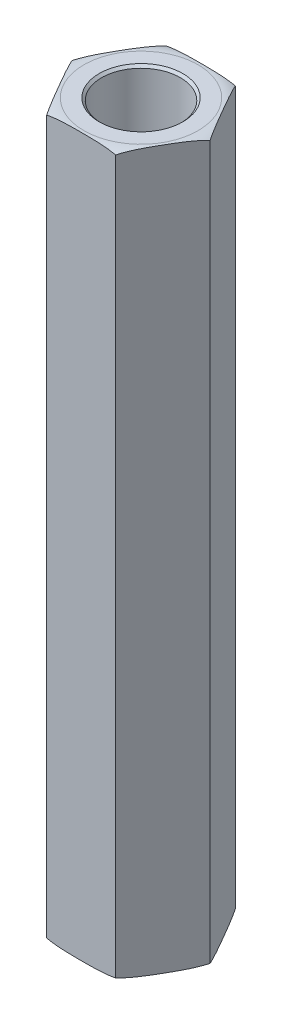
ISO-10303-21;
HEADER;
FILE_DESCRIPTION(('STEP AP214'),'2;1');
FILE_NAME('part.step','',(''),(''),'','','');
FILE_SCHEMA(('AUTOMOTIVE_DESIGN { 1 0 10303 214 1 1 1 1 }'));
ENDSEC;
DATA;
#1=APPLICATION_CONTEXT('core data for automotive mechanical design processes');
#2=APPLICATION_PROTOCOL_DEFINITION('international standard','automotive_design',2000,#1);
#3=PRODUCT_CONTEXT('',#1,'mechanical');
#4=PRODUCT('Part','Part','',(#3));
#5=PRODUCT_RELATED_PRODUCT_CATEGORY('part','',(#4));
#6=PRODUCT_DEFINITION_FORMATION('','',#4);
#7=PRODUCT_DEFINITION_CONTEXT('part definition',#1,'design');
#8=PRODUCT_DEFINITION('design','',#6,#7);
#9=PRODUCT_DEFINITION_SHAPE('','',#8);
#10=(LENGTH_UNIT() NAMED_UNIT(*) SI_UNIT(.MILLI.,.METRE.));
#11=(NAMED_UNIT(*) PLANE_ANGLE_UNIT() SI_UNIT($,.RADIAN.));
#12=(NAMED_UNIT(*) SI_UNIT($,.STERADIAN.) SOLID_ANGLE_UNIT());
#13=UNCERTAINTY_MEASURE_WITH_UNIT(LENGTH_MEASURE(1.E-05),#10,'distance_accuracy_value','');
#14=(GEOMETRIC_REPRESENTATION_CONTEXT(3) GLOBAL_UNCERTAINTY_ASSIGNED_CONTEXT((#13)) GLOBAL_UNIT_ASSIGNED_CONTEXT((#10,
#11,#12)) REPRESENTATION_CONTEXT('',''));
#15=CARTESIAN_POINT('',(0.,0.,0.));
#16=DIRECTION('',(0.,0.,1.));
#17=DIRECTION('',(1.,0.,0.));
#18=AXIS2_PLACEMENT_3D('',#15,#16,#17);
#19=CARTESIAN_POINT('',(0.,-6.35,0.));
#20=DIRECTION('',(0.,-1.,0.));
#21=DIRECTION('',(0.,0.,-1.));
#22=AXIS2_PLACEMENT_3D('',#19,#20,#21);
#23=PLANE('',#22);
#24=CARTESIAN_POINT('',(0.,-6.35,0.));
#25=DIRECTION('',(0.,-1.,0.));
#26=DIRECTION('',(0.,0.,-1.));
#27=AXIS2_PLACEMENT_3D('',#24,#25,#26);
#28=CIRCLE('',#27,2.0955);
#29=CARTESIAN_POINT('',(0.,-6.35,-2.0955));
#30=VERTEX_POINT('',#29);
#31=EDGE_CURVE('E22',#30,#30,#28,.T.);
#32=ORIENTED_EDGE('',*,*,#31,.T.);
#33=EDGE_LOOP('',(#32));
#34=FACE_BOUND('',#33,.T.);
#35=ADVANCED_FACE('F17',(#34),#23,.T.);
#36=CARTESIAN_POINT('',(0.,-6.35,0.));
#37=DIRECTION('',(0.,-1.,0.));
#38=DIRECTION('',(0.,0.,-1.));
#39=AXIS2_PLACEMENT_3D('',#36,#37,#38);
#40=CYLINDRICAL_SURFACE('',#39,2.0955);
#41=ORIENTED_EDGE('',*,*,#31,.F.);
#42=EDGE_LOOP('',(#41));
#43=FACE_BOUND('',#42,.T.);
#44=CARTESIAN_POINT('',(0.,-18.9229999999725,0.));
#45=DIRECTION('',(0.,-1.,0.));
#46=DIRECTION('',(0.,0.,-1.));
#47=AXIS2_PLACEMENT_3D('',#44,#45,#46);
#48=CIRCLE('',#47,2.09550000005265);
#49=CARTESIAN_POINT('',(0.,-18.9229999999725,-2.09550000005265));
#50=VERTEX_POINT('',#49);
#51=EDGE_CURVE('E127',#50,#50,#48,.T.);
#52=ORIENTED_EDGE('',*,*,#51,.T.);
#53=EDGE_LOOP('',(#52));
#54=FACE_BOUND('',#53,.T.);
#55=ADVANCED_FACE('F238',(#43,#54),#40,.F.);
#56=CARTESIAN_POINT('',(0.,6.35,0.));
#57=DIRECTION('',(0.,1.,0.));
#58=DIRECTION('',(0.,0.,1.));
#59=AXIS2_PLACEMENT_3D('',#56,#57,#58);
#60=PLANE('',#59);
#61=CARTESIAN_POINT('',(0.,6.35,0.));
#62=DIRECTION('',(0.,1.,0.));
#63=DIRECTION('',(0.,0.,1.));
#64=AXIS2_PLACEMENT_3D('',#61,#62,#63);
#65=CIRCLE('',#64,2.0955);
#66=CARTESIAN_POINT('',(0.,6.35,2.0955));
#67=VERTEX_POINT('',#66);
#68=EDGE_CURVE('E105',#67,#67,#65,.T.);
#69=ORIENTED_EDGE('',*,*,#68,.T.);
#70=EDGE_LOOP('',(#69));
#71=FACE_BOUND('',#70,.T.);
#72=ADVANCED_FACE('F242',(#71),#60,.T.);
#73=CARTESIAN_POINT('',(0.,-19.0499999999361,0.));
#74=DIRECTION('',(0.,-1.,0.));
#75=DIRECTION('',(0.,0.,-1.));
#76=AXIS2_PLACEMENT_3D('',#73,#74,#75);
#77=CONICAL_SURFACE('',#76,2.22250000001623,0.785398163397448);
#78=ORIENTED_EDGE('',*,*,#51,.F.);
#79=EDGE_LOOP('',(#78));
#80=FACE_BOUND('',#79,.T.);
#81=CARTESIAN_POINT('',(0.,-19.0499999999361,0.));
#82=DIRECTION('',(0.,-1.,0.));
#83=DIRECTION('',(0.,0.,-1.));
#84=AXIS2_PLACEMENT_3D('',#81,#82,#83);
#85=CIRCLE('',#84,2.22250000001623);
#86=CARTESIAN_POINT('',(0.,-19.0499999999361,-2.22250000001623));
#87=VERTEX_POINT('',#86);
#88=EDGE_CURVE('E116',#87,#87,#85,.F.);
#89=ORIENTED_EDGE('',*,*,#88,.F.);
#90=EDGE_LOOP('',(#89));
#91=FACE_BOUND('',#90,.T.);
#92=ADVANCED_FACE('F246',(#80,#91),#77,.F.);
#93=CARTESIAN_POINT('',(0.,6.35,0.));
#94=DIRECTION('',(0.,1.,0.));
#95=DIRECTION('',(0.,0.,1.));
#96=AXIS2_PLACEMENT_3D('',#93,#94,#95);
#97=CYLINDRICAL_SURFACE('',#96,2.0955);
#98=ORIENTED_EDGE('',*,*,#68,.F.);
#99=EDGE_LOOP('',(#98));
#100=FACE_BOUND('',#99,.T.);
#101=CARTESIAN_POINT('',(0.,18.9229999999725,0.));
#102=DIRECTION('',(0.,1.,0.));
#103=DIRECTION('',(0.,0.,1.));
#104=AXIS2_PLACEMENT_3D('',#101,#102,#103);
#105=CIRCLE('',#104,2.09550000005265);
#106=CARTESIAN_POINT('',(0.,18.9229999999725,2.09550000005265));
#107=VERTEX_POINT('',#106);
#108=EDGE_CURVE('E110',#107,#107,#105,.T.);
#109=ORIENTED_EDGE('',*,*,#108,.T.);
#110=EDGE_LOOP('',(#109));
#111=FACE_BOUND('',#110,.T.);
#112=ADVANCED_FACE('F249',(#100,#111),#97,.F.);
#113=CARTESIAN_POINT('',(-1.83308710468,-19.05,-3.175));
#114=DIRECTION('',(0.,-1.,0.));
#115=DIRECTION('',(0.,0.,-1.));
#116=AXIS2_PLACEMENT_3D('',#113,#114,#115);
#117=PLANE('',#116);
#118=ORIENTED_EDGE('',*,*,#88,.T.);
#119=EDGE_LOOP('',(#118));
#120=FACE_BOUND('',#119,.T.);
#121=CARTESIAN_POINT('',(1.1159149628,-19.05,2.81828864442));
#122=CARTESIAN_POINT('',(0.578263806384786,-19.05,3.03117420935));
#123=CARTESIAN_POINT('',(0.,-19.05,3.03117420935));
#124=B_SPLINE_CURVE_WITH_KNOTS('',2,(#121,#122,#123),.UNSPECIFIED.,.F.,.F.,(3,3),(0.,1.),.UNSPECIFIED.);
#125=CARTESIAN_POINT('',(1.1159149628,-19.05,2.81828864442));
#126=VERTEX_POINT('',#125);
#127=CARTESIAN_POINT('',(0.,-19.0499999999903,3.03117420935001));
#128=VERTEX_POINT('',#127);
#129=EDGE_CURVE('E108',#126,#128,#124,.T.);
#130=ORIENTED_EDGE('',*,*,#129,.T.);
#131=CARTESIAN_POINT('',(0.,-19.0499999999806,0.));
#132=DIRECTION('',(0.,-1.,0.));
#133=DIRECTION('',(0.,0.,-1.));
#134=AXIS2_PLACEMENT_3D('',#131,#132,#133);
#135=CIRCLE('',#134,3.03117420935);
#136=CARTESIAN_POINT('',(0.,-19.0499999999903,-3.03117420935001));
#137=VERTEX_POINT('',#136);
#138=EDGE_CURVE('E101',#137,#128,#135,.F.);
#139=ORIENTED_EDGE('',*,*,#138,.F.);
#140=CARTESIAN_POINT('',(0.,-19.05,-3.03117420935));
#141=CARTESIAN_POINT('',(0.578261264918406,-19.05,-3.03117420935));
#142=CARTESIAN_POINT('',(1.11591040282,-19.05,-2.81829044996));
#143=B_SPLINE_CURVE_WITH_KNOTS('',2,(#140,#141,#142),.UNSPECIFIED.,.F.,.F.,(3,3),(0.,1.),.UNSPECIFIED.);
#144=CARTESIAN_POINT('',(1.11591040282,-19.05,-2.81829044996));
#145=VERTEX_POINT('',#144);
#146=EDGE_CURVE('E97',#137,#145,#143,.T.);
#147=ORIENTED_EDGE('',*,*,#146,.T.);
#148=CARTESIAN_POINT('',(1.11591040282,-19.05,-2.81829044996));
#149=CARTESIAN_POINT('',(1.69952038244857,-19.05,-2.58720835993238));
#150=CARTESIAN_POINT('',(2.14336641133,-19.05,-2.14336126545));
#151=B_SPLINE_CURVE_WITH_KNOTS('',2,(#148,#149,#150),.UNSPECIFIED.,.F.,.F.,(3,3),(0.,1.),.UNSPECIFIED.);
#152=CARTESIAN_POINT('',(2.14336641133,-19.05,-2.14336126545));
#153=VERTEX_POINT('',#152);
#154=EDGE_CURVE('E103',#145,#153,#151,.T.);
#155=ORIENTED_EDGE('',*,*,#154,.T.);
#156=CARTESIAN_POINT('',(2.14336641133,-19.05,-2.14336126545));
#157=CARTESIAN_POINT('',(2.58720785568844,-19.05,-1.69951875549663));
#158=CARTESIAN_POINT('',(2.81828855163,-19.05,-1.11591519714));
#159=B_SPLINE_CURVE_WITH_KNOTS('',2,(#156,#157,#158),.UNSPECIFIED.,.F.,.F.,(3,3),(0.,1.),.UNSPECIFIED.);
#160=CARTESIAN_POINT('',(2.81828855163,-19.05,-1.11591519714));
#161=VERTEX_POINT('',#160);
#162=EDGE_CURVE('E268',#153,#161,#159,.T.);
#163=ORIENTED_EDGE('',*,*,#162,.T.);
#164=CARTESIAN_POINT('',(2.81828855163,-19.05,-1.11591519714));
#165=CARTESIAN_POINT('',(3.03117326999005,-19.05,-0.578266309377845));
#166=CARTESIAN_POINT('',(3.03117420935,-19.05,-4.92400771632401E-06));
#167=B_SPLINE_CURVE_WITH_KNOTS('',2,(#164,#165,#166),.UNSPECIFIED.,.F.,.F.,(3,3),(0.,1.),.UNSPECIFIED.);
#168=CARTESIAN_POINT('',(3.03117420935,-19.05,-4.92400771632401E-06));
#169=VERTEX_POINT('',#168);
#170=EDGE_CURVE('E272',#161,#169,#167,.T.);
#171=ORIENTED_EDGE('',*,*,#170,.T.);
#172=CARTESIAN_POINT('',(3.03117420935,-19.05,-4.92400771632401E-06));
#173=CARTESIAN_POINT('',(3.03117514871005,-19.05,0.578257948095633));
#174=CARTESIAN_POINT('',(2.81829112091,-19.05,1.11590870829));
#175=B_SPLINE_CURVE_WITH_KNOTS('',2,(#172,#173,#174),.UNSPECIFIED.,.F.,.F.,(3,3),(0.,1.),.UNSPECIFIED.);
#176=CARTESIAN_POINT('',(2.81829112091,-19.05,1.11590870829));
#177=VERTEX_POINT('',#176);
#178=EDGE_CURVE('E276',#169,#177,#175,.T.);
#179=ORIENTED_EDGE('',*,*,#178,.T.);
#180=CARTESIAN_POINT('',(2.81829112091,-19.05,1.11590870829));
#181=CARTESIAN_POINT('',(2.58720907067836,-19.05,1.69951961259899));
#182=CARTESIAN_POINT('',(2.14336140816,-19.05,2.14336626863));
#183=B_SPLINE_CURVE_WITH_KNOTS('',2,(#180,#181,#182),.UNSPECIFIED.,.F.,.F.,(3,3),(0.,1.),.UNSPECIFIED.);
#184=CARTESIAN_POINT('',(2.14336140816,-19.05,2.14336626863));
#185=VERTEX_POINT('',#184);
#186=EDGE_CURVE('E279',#177,#185,#183,.T.);
#187=ORIENTED_EDGE('',*,*,#186,.T.);
#188=CARTESIAN_POINT('',(2.14336140816,-19.05,2.14336626863));
#189=CARTESIAN_POINT('',(1.69951876041376,-19.05,2.58720790987557));
#190=CARTESIAN_POINT('',(1.1159149628,-19.05,2.81828864442));
#191=B_SPLINE_CURVE_WITH_KNOTS('',2,(#188,#189,#190),.UNSPECIFIED.,.F.,.F.,(3,3),(0.,1.),.UNSPECIFIED.);
#192=EDGE_CURVE('E282',#185,#126,#191,.T.);
#193=ORIENTED_EDGE('',*,*,#192,.T.);
#194=EDGE_LOOP('',(#130,#139,#147,#155,#163,#171,#179,#187,#193));
#195=FACE_BOUND('',#194,.T.);
#196=ADVANCED_FACE('F107',(#120,#195),#117,.T.);
#197=CARTESIAN_POINT('',(0.,19.0499999998792,0.));
#198=DIRECTION('',(0.,1.,0.));
#199=DIRECTION('',(0.,0.,1.));
#200=AXIS2_PLACEMENT_3D('',#197,#198,#199);
#201=CONICAL_SURFACE('',#200,2.22249999995938,0.785398163397448);
#202=ORIENTED_EDGE('',*,*,#108,.F.);
#203=EDGE_LOOP('',(#202));
#204=FACE_BOUND('',#203,.T.);
#205=CARTESIAN_POINT('',(0.,19.0499999999929,0.));
#206=DIRECTION('',(0.,1.,0.));
#207=DIRECTION('',(0.,0.,1.));
#208=AXIS2_PLACEMENT_3D('',#205,#206,#207);
#209=CIRCLE('',#208,2.22250000007307);
#210=CARTESIAN_POINT('',(0.,19.0499999999929,2.22250000007307));
#211=VERTEX_POINT('',#210);
#212=EDGE_CURVE('E199',#211,#211,#209,.T.);
#213=ORIENTED_EDGE('',*,*,#212,.T.);
#214=EDGE_LOOP('',(#213));
#215=FACE_BOUND('',#214,.T.);
#216=ADVANCED_FACE('F256',(#204,#215),#201,.F.);
#217=CARTESIAN_POINT('',(-1.83308710468,19.05,-3.175));
#218=DIRECTION('',(0.866025403784329,0.,0.50000000000019));
#219=DIRECTION('',(0.50000000000019,0.,-0.866025403784329));
#220=AXIS2_PLACEMENT_3D('',#217,#218,#219);
#221=PLANE('',#220);
#222=CARTESIAN_POINT('',(-1.83308710467695,18.9230000000293,-3.17500000000529));
#223=CARTESIAN_POINT('',(-1.8617308860595,18.9349320247198,-3.12538751532983));
#224=CARTESIAN_POINT('',(-1.89050185601831,18.9455561469771,-3.07555473357817));
#225=CARTESIAN_POINT('',(-1.94821671992564,18.9645286938417,-2.97558965693879));
#226=CARTESIAN_POINT('',(-1.97716051696366,18.9728782901184,-2.92545752990501));
#227=CARTESIAN_POINT('',(-2.06405216498905,18.9950101508783,-2.77495678077171));
#228=CARTESIAN_POINT('',(-2.12218076373196,19.005922538432,-2.67427509437627));
#229=CARTESIAN_POINT('',(-2.23856053176623,19.0225474671079,-2.47269942316793));
#230=CARTESIAN_POINT('',(-2.29681159180664,19.0282635139539,-2.37180562758324));
#231=CARTESIAN_POINT('',(-2.41339766078111,19.0365432523938,-2.16987263266483));
#232=CARTESIAN_POINT('',(-2.47173269885674,19.0391051045644,-2.06883338285643));
#233=CARTESIAN_POINT('',(-2.58787917624348,19.0424800877965,-1.86766178290255));
#234=CARTESIAN_POINT('',(-2.6456905288722,19.043308985297,-1.76752958289538));
#235=CARTESIAN_POINT('',(-2.7613062919446,19.0439023514454,-1.56727720709824));
#236=CARTESIAN_POINT('',(-2.81911070220161,19.0436669719808,-1.46715703163158));
#237=CARTESIAN_POINT('',(-2.93473417637818,19.0419339874474,-1.26689129981025));
#238=CARTESIAN_POINT('',(-2.99255323893653,19.0404359711881,-1.16674574581323));
#239=CARTESIAN_POINT('',(-3.1081660593277,19.0351753166789,-0.966498466889494));
#240=CARTESIAN_POINT('',(-3.16595981909064,19.0314129012772,-0.866396738619704));
#241=CARTESIAN_POINT('',(-3.26076771638769,19.0219889929251,-0.702184643542513));
#242=CARTESIAN_POINT('',(-3.29780938945347,19.0174905765212,-0.638026583795261));
#243=CARTESIAN_POINT('',(-3.371790707615,19.0063014818782,-0.509887181928634));
#244=CARTESIAN_POINT('',(-3.40873039930005,18.999612071978,-0.445905759114239));
#245=CARTESIAN_POINT('',(-3.48256270809991,18.9833978037691,-0.318024449032822));
#246=CARTESIAN_POINT('',(-3.51945492098773,18.9738652499793,-0.254125261907509));
#247=CARTESIAN_POINT('',(-3.59302299993464,18.9512629144164,-0.126701611356298));
#248=CARTESIAN_POINT('',(-3.62969844258157,18.9381876787717,-0.0631778813017524));
#249=CARTESIAN_POINT('',(-3.66617420935903,18.9230000000291,1.80158925078053E-12));
#250=B_SPLINE_CURVE_WITH_KNOTS('',3,(#222,#223,#224,#225,#226,#227,#228,#229,#230,#231,#232,
#233,#234,#235,#236,#237,#238,#239,#240,#241,#242,#243,#244,#245,#246,#247,#248,#249),
.UNSPECIFIED.,.F.,.F.,(4,2,2,2,2,2,2,2,2,2,2,2,2,4),(0.,0.175509467510421,0.350928353687514,
0.701031262076355,1.05089779702913,1.40096826623835,1.74783967880613,2.09466158943713,
2.44159648979614,2.78849725253497,3.01113198346214,3.23363806101193,3.45675194285082,
3.68021127402309),.UNSPECIFIED.);
#251=CARTESIAN_POINT('',(-1.83308710467847,18.9230000000146,-3.17500000000264));
#252=VERTEX_POINT('',#251);
#253=CARTESIAN_POINT('',(-3.66617420935451,18.9230000000146,9.02417244523778E-13));
#254=VERTEX_POINT('',#253);
#255=EDGE_CURVE('E228',#252,#254,#250,.T.);
#256=ORIENTED_EDGE('',*,*,#255,.F.);
#257=DIRECTION('',(0.,1.,0.));
#258=VECTOR('',#257,1.);
#259=CARTESIAN_POINT('',(-1.83308710468,19.05,-3.175));
#260=LINE('',#259,#258);
#261=CARTESIAN_POINT('',(-1.83308710471647,-18.9230000000002,-3.17500000006316));
#262=VERTEX_POINT('',#261);
#263=EDGE_CURVE('E194',#252,#262,#260,.F.);
#264=ORIENTED_EDGE('',*,*,#263,.T.);
#265=CARTESIAN_POINT('',(-3.66617420919529,-18.9230000000127,-1.25582000597824E-10));
#266=CARTESIAN_POINT('',(-3.63753042785017,-18.9349320247382,-0.0496124848348569));
#267=CARTESIAN_POINT('',(-3.60875945790233,-18.9455561470101,-0.0994452666093257));
#268=CARTESIAN_POINT('',(-3.55104459399287,-18.964528693885,-0.199410343283897));
#269=CARTESIAN_POINT('',(-3.52210079694178,-18.9728782901573,-0.249542470330059));
#270=CARTESIAN_POINT('',(-3.43520914888422,-18.9950101509082,-0.400043219502621));
#271=CARTESIAN_POINT('',(-3.37708055012887,-19.0059225384615,-0.500724905927643));
#272=CARTESIAN_POINT('',(-3.26070078206502,-19.0225474671326,-0.702300577193083));
#273=CARTESIAN_POINT('',(-3.20244972200748,-19.0282635139743,-0.803194372805291));
#274=CARTESIAN_POINT('',(-3.08586365300001,-19.0365432524072,-1.00512736777929));
#275=CARTESIAN_POINT('',(-3.0275286149085,-19.0391051045751,-1.10616661761577));
#276=CARTESIAN_POINT('',(-2.91138213749041,-19.0424800878025,-1.30733821762437));
#277=CARTESIAN_POINT('',(-2.85357078484623,-19.0433089853009,-1.40747041765818));
#278=CARTESIAN_POINT('',(-2.737955021743,-19.043902351445,-1.6077227935086));
#279=CARTESIAN_POINT('',(-2.68015061147063,-19.0436669719782,-1.70784296900189));
#280=CARTESIAN_POINT('',(-2.56452713726345,-19.0419339874386,-1.90810870087629));
#281=CARTESIAN_POINT('',(-2.50670807468984,-19.0404359711752,-2.00825425489973));
#282=CARTESIAN_POINT('',(-2.39109525426825,-19.0351753166532,-2.20850153387614));
#283=CARTESIAN_POINT('',(-2.33330149449016,-19.0314129012429,-2.30860326217218));
#284=CARTESIAN_POINT('',(-2.23849359721223,-19.0219889928749,-2.47281535721624));
#285=CARTESIAN_POINT('',(-2.20145192418058,-19.0174905764678,-2.53697341690438));
#286=CARTESIAN_POINT('',(-2.12747060608729,-19.0063014818204,-2.66511281865281));
#287=CARTESIAN_POINT('',(-2.09053091443636,-18.9996120719192,-2.72909424140812));
#288=CARTESIAN_POINT('',(-2.01669860570478,-18.9833978037116,-2.85697555137125));
#289=CARTESIAN_POINT('',(-1.97980639285115,-18.9738652499242,-2.92087473843736));
#290=CARTESIAN_POINT('',(-1.90623831397243,-18.9512629143716,-3.04829838887048));
#291=CARTESIAN_POINT('',(-1.86956287135949,-18.9381876787349,-3.11182211886612));
#292=CARTESIAN_POINT('',(-1.83308710461577,-18.9230000000038,-3.17500000011126));
#293=B_SPLINE_CURVE_WITH_KNOTS('',3,(#265,#266,#267,#268,#269,#270,#271,#272,#273,#274,#275,
#276,#277,#278,#279,#280,#281,#282,#283,#284,#285,#286,#287,#288,#289,#290,#291,#292),
.UNSPECIFIED.,.F.,.F.,(4,2,2,2,2,2,2,2,2,2,2,2,2,4),(0.,0.175509467560527,0.35092835378654,
0.701031262271112,1.05089779732005,1.40096826662595,1.74783967928609,2.09466159000934,
2.44159649046002,2.78849725329038,3.01113198401376,3.23363806136005,3.45675194299479,
3.68021127396213),.UNSPECIFIED.);
#294=CARTESIAN_POINT('',(-3.66617420938593,-18.9229999996834,-2.10191728042252E-10));
#295=VERTEX_POINT('',#294);
#296=EDGE_CURVE('E109',#295,#262,#293,.T.);
#297=ORIENTED_EDGE('',*,*,#296,.F.);
#298=DIRECTION('',(0.,1.,0.));
#299=VECTOR('',#298,1.);
#300=CARTESIAN_POINT('',(-3.66617420950329,19.05,-2.65503180982558E-10));
#301=LINE('',#300,#299);
#302=EDGE_CURVE('E227',#295,#254,#301,.T.);
#303=ORIENTED_EDGE('',*,*,#302,.T.);
#304=EDGE_LOOP('',(#256,#264,#297,#303));
#305=FACE_BOUND('',#304,.T.);
#306=ADVANCED_FACE('F213',(#305),#221,.F.);
#307=CARTESIAN_POINT('',(-3.66617420935,19.05,0.));
#308=DIRECTION('',(0.866025403784329,0.,-0.50000000000019));
#309=DIRECTION('',(-0.50000000000019,0.,-0.866025403784329));
#310=AXIS2_PLACEMENT_3D('',#307,#308,#309);
#311=PLANE('',#310);
#312=CARTESIAN_POINT('',(-3.66617420935386,18.9230000000313,-6.6830657006074E-12));
#313=CARTESIAN_POINT('',(-3.63753042797114,18.9349320247218,0.0496124846690486));
#314=CARTESIAN_POINT('',(-3.60875945801218,18.9455561469791,0.0994452664209782));
#315=CARTESIAN_POINT('',(-3.55104459410453,18.9645286938436,0.199410343060903));
#316=CARTESIAN_POINT('',(-3.52210079706636,18.9728782901202,0.249542470094953));
#317=CARTESIAN_POINT('',(-3.4352091490405,18.9950101508801,0.40004321922906));
#318=CARTESIAN_POINT('',(-3.37708055029729,19.0059225384336,0.500724905625038));
#319=CARTESIAN_POINT('',(-3.26070078226239,19.0225474671093,0.702300576834451));
#320=CARTESIAN_POINT('',(-3.20244972222167,19.0282635139551,0.803194372419676));
#321=CARTESIAN_POINT('',(-3.08586365324658,19.0365432523948,1.00512736733915));
#322=CARTESIAN_POINT('',(-3.02752861517065,19.0391051045653,1.10616661714809));
#323=CARTESIAN_POINT('',(-2.91138213778329,19.0424800877973,1.30733821710304));
#324=CARTESIAN_POINT('',(-2.85357078515426,19.0433089852977,1.40747041711074));
#325=CARTESIAN_POINT('',(-2.73795502208124,19.043902351446,1.60772279290896));
#326=CARTESIAN_POINT('',(-2.68015061182392,19.0436669719813,1.70784296837615));
#327=CARTESIAN_POINT('',(-2.56452713764673,19.0419339874479,1.90810870019856));
#328=CARTESIAN_POINT('',(-2.50670807508808,19.0404359711887,2.00825425419611));
#329=CARTESIAN_POINT('',(-2.39109525469629,19.0351753166795,2.20850153312092));
#330=CARTESIAN_POINT('',(-2.33330149493304,19.0314129012778,2.30860326139124));
#331=CARTESIAN_POINT('',(-2.23849359763621,19.0219889929257,2.47281535646804));
#332=CARTESIAN_POINT('',(-2.20145192457097,19.0174905765219,2.53697341621436));
#333=CARTESIAN_POINT('',(-2.1274706064105,19.006301481879,2.66511281807914));
#334=CARTESIAN_POINT('',(-2.09053091472599,18.9996120719789,2.72909424089262));
#335=CARTESIAN_POINT('',(-2.01669860592719,18.9833978037703,2.85697555097219));
#336=CARTESIAN_POINT('',(-1.9798063930399,18.9738652499807,2.92087473809658));
#337=CARTESIAN_POINT('',(-1.90623831409406,18.9512629144183,3.04829838864596));
#338=CARTESIAN_POINT('',(-1.86956287144764,18.9381876787739,3.1118221186996));
#339=CARTESIAN_POINT('',(-1.8330871046707,18.9230000000317,3.17500000000226));
#340=B_SPLINE_CURVE_WITH_KNOTS('',3,(#312,#313,#314,#315,#316,#317,#318,#319,#320,#321,#322,
#323,#324,#325,#326,#327,#328,#329,#330,#331,#332,#333,#334,#335,#336,#337,#338,#339),
.UNSPECIFIED.,.F.,.F.,(4,2,2,2,2,2,2,2,2,2,2,2,2,4),(0.,0.175509467511335,0.35092835368934,
0.701031262079996,1.0508977970346,1.40096826624566,1.7478396788153,2.09466158944817,
2.44159648980902,2.78849725254971,3.01113198347366,3.23363806102025,3.4567519428559,
3.68021127402492),.UNSPECIFIED.);
#341=CARTESIAN_POINT('',(-1.83308710467783,18.9230000000306,3.17500000000113));
#342=VERTEX_POINT('',#341);
#343=EDGE_CURVE('E218',#254,#342,#340,.T.);
#344=ORIENTED_EDGE('',*,*,#343,.F.);
#345=ORIENTED_EDGE('',*,*,#302,.F.);
#346=CARTESIAN_POINT('',(-1.833087104667,-18.9230000000285,3.17499999999934));
#347=CARTESIAN_POINT('',(-1.86173088605233,-18.9349320247211,3.12538751532497));
#348=CARTESIAN_POINT('',(-1.89050185601255,-18.9455561469793,3.07555473357336));
#349=CARTESIAN_POINT('',(-1.94821671992146,-18.9645286938446,2.97558965693313));
#350=CARTESIAN_POINT('',(-1.97716051695964,-18.972878290121,2.92545752989846));
#351=CARTESIAN_POINT('',(-2.06405216498583,-18.9950101508805,2.7749567807628));
#352=CARTESIAN_POINT('',(-2.12218076372971,-19.0059225384342,2.67427509436614));
#353=CARTESIAN_POINT('',(-2.23856053176567,-19.0225474671099,2.47269942315523));
#354=CARTESIAN_POINT('',(-2.29681159180679,-19.0282635139556,2.37180562756918));
#355=CARTESIAN_POINT('',(-2.41339766078275,-19.0365432523951,2.16987263264811));
#356=CARTESIAN_POINT('',(-2.47173269885915,-19.0391051045655,2.06883338283841));
#357=CARTESIAN_POINT('',(-2.58787917624719,-19.0424800877974,1.8676617828823));
#358=CARTESIAN_POINT('',(-2.64569052887643,-19.0433089852978,1.76752958287422));
#359=CARTESIAN_POINT('',(-2.76130629194988,-19.043902351446,1.56727720707524));
#360=CARTESIAN_POINT('',(-2.81911070220742,-19.0436669719813,1.46715703160768));
#361=CARTESIAN_POINT('',(-2.93473417638506,-19.0419339874478,1.26689129978449));
#362=CARTESIAN_POINT('',(-2.99255323894395,-19.0404359711884,1.16674574578653));
#363=CARTESIAN_POINT('',(-3.10816605933621,-19.035175316679,0.9664984668609));
#364=CARTESIAN_POINT('',(-3.1659598190997,-19.0314129012771,0.866396738590169));
#365=CARTESIAN_POINT('',(-3.26076771641441,-19.0219889929228,0.702184643482402));
#366=CARTESIAN_POINT('',(-3.29780938949728,-19.0174905765163,0.638026583705543));
#367=CARTESIAN_POINT('',(-3.37179070769286,-19.0063014818657,0.509887181779944));
#368=CARTESIAN_POINT('',(-3.40873039939486,-18.9996120719605,0.445905758936184));
#369=CARTESIAN_POINT('',(-3.48256270822855,-18.9833978037384,0.318024448796173));
#370=CARTESIAN_POINT('',(-3.51945492113324,-18.9738652499402,0.254125261641632));
#371=CARTESIAN_POINT('',(-3.59302300011354,-18.9512629143563,0.126701611032591));
#372=CARTESIAN_POINT('',(-3.62969844277699,-18.938187678699,0.0631778809494447));
#373=CARTESIAN_POINT('',(-3.6661742095706,-18.922999999941,-3.82089576360477E-10));
#374=B_SPLINE_CURVE_WITH_KNOTS('',3,(#346,#347,#348,#349,#350,#351,#352,#353,#354,#355,#356,
#357,#358,#359,#360,#361,#362,#363,#364,#365,#366,#367,#368,#369,#370,#371,#372,#373),
.UNSPECIFIED.,.F.,.F.,(4,2,2,2,2,2,2,2,2,2,2,2,2,4),(0.,0.175509467512889,0.350928353692378,
0.701031262085876,1.05089779704317,1.40096826625694,1.74783967882789,2.09466158946205,
2.44159648982433,2.78849725256644,3.01113198359642,3.23363806124881,3.45675194319115,
3.68021127446751),.UNSPECIFIED.);
#375=CARTESIAN_POINT('',(-1.83308710467535,-18.9230000000159,3.17500000000113));
#376=VERTEX_POINT('',#375);
#377=EDGE_CURVE('E113',#376,#295,#374,.T.);
#378=ORIENTED_EDGE('',*,*,#377,.F.);
#379=DIRECTION('',(0.,1.,0.));
#380=VECTOR('',#379,1.);
#381=CARTESIAN_POINT('',(-1.83308710468,19.05,3.175));
#382=LINE('',#381,#380);
#383=EDGE_CURVE('E333',#376,#342,#382,.T.);
#384=ORIENTED_EDGE('',*,*,#383,.T.);
#385=EDGE_LOOP('',(#344,#345,#378,#384));
#386=FACE_BOUND('',#385,.T.);
#387=ADVANCED_FACE('F209',(#386),#311,.F.);
#388=CARTESIAN_POINT('',(-1.83308710468,19.05,-3.175));
#389=DIRECTION('',(0.,-1.,0.));
#390=DIRECTION('',(0.,0.,-1.));
#391=AXIS2_PLACEMENT_3D('',#388,#389,#390);
#392=PLANE('',#391);
#393=ORIENTED_EDGE('',*,*,#212,.F.);
#394=EDGE_LOOP('',(#393));
#395=FACE_BOUND('',#394,.T.);
#396=CARTESIAN_POINT('',(0.,19.0499999999806,0.));
#397=DIRECTION('',(0.,1.,0.));
#398=DIRECTION('',(0.,0.,1.));
#399=AXIS2_PLACEMENT_3D('',#396,#397,#398);
#400=CIRCLE('',#399,3.03117420935);
#401=CARTESIAN_POINT('',(0.,19.0499999999806,3.03117420935));
#402=VERTEX_POINT('',#401);
#403=EDGE_CURVE('E336',#402,#402,#400,.F.);
#404=ORIENTED_EDGE('',*,*,#403,.F.);
#405=EDGE_LOOP('',(#404));
#406=FACE_BOUND('',#405,.T.);
#407=ADVANCED_FACE('F204',(#395,#406),#392,.F.);
#408=CARTESIAN_POINT('',(1.83308710468,19.05,-3.175));
#409=DIRECTION('',(0.,0.,1.));
#410=DIRECTION('',(1.,0.,0.));
#411=AXIS2_PLACEMENT_3D('',#408,#409,#410);
#412=PLANE('',#411);
#413=ORIENTED_EDGE('',*,*,#263,.F.);
#414=CARTESIAN_POINT('',(1.83308710468266,18.92300000003,-3.175));
#415=CARTESIAN_POINT('',(1.75760871055236,18.9387123012471,-3.175));
#416=CARTESIAN_POINT('',(1.68170571469055,18.9521647800988,-3.175));
#417=CARTESIAN_POINT('',(1.52939807528087,18.9753048647096,-3.175));
#418=CARTESIAN_POINT('',(1.45299400110457,18.984996175032,-3.175));
#419=CARTESIAN_POINT('',(1.30011823210022,19.0013713526697,-3.175));
#420=CARTESIAN_POINT('',(1.22364747610439,19.0080644224743,-3.175));
#421=CARTESIAN_POINT('',(1.07052459410399,19.0191724169891,-3.175));
#422=CARTESIAN_POINT('',(0.993872424118212,19.0235867165442,-3.175));
#423=CARTESIAN_POINT('',(0.84085691019785,19.0307241980153,-3.175));
#424=CARTESIAN_POINT('',(0.764493913331043,19.0334552736642,-3.175));
#425=CARTESIAN_POINT('',(0.611734616939815,19.0377563225648,-3.175));
#426=CARTESIAN_POINT('',(0.53533831633249,19.039326254723,-3.175));
#427=CARTESIAN_POINT('',(0.382454231227137,19.041682470749,-3.175));
#428=CARTESIAN_POINT('',(0.30596643511561,19.0424679275795,-3.175));
#429=CARTESIAN_POINT('',(0.152985759387297,19.0434884106727,-3.175));
#430=CARTESIAN_POINT('',(0.0764928796936491,19.0437234241318,-3.175));
#431=CARTESIAN_POINT('',(-0.0764928796937918,19.0437234241318,-3.175));
#432=CARTESIAN_POINT('',(-0.152985759387585,19.0434884106727,-3.175));
#433=CARTESIAN_POINT('',(-0.305966435116189,19.0424679275795,-3.175));
#434=CARTESIAN_POINT('',(-0.382454231227861,19.041682470749,-3.175));
#435=CARTESIAN_POINT('',(-0.535338316333505,19.039326254723,-3.175));
#436=CARTESIAN_POINT('',(-0.611734616940976,19.0377563225647,-3.175));
#437=CARTESIAN_POINT('',(-0.764493913332493,19.0334552736642,-3.175));
#438=CARTESIAN_POINT('',(-0.840856910199445,19.0307241980152,-3.175));
#439=CARTESIAN_POINT('',(-0.993872424120098,19.0235867165441,-3.175));
#440=CARTESIAN_POINT('',(-1.07052459410602,19.019172416989,-3.175));
#441=CARTESIAN_POINT('',(-1.22364747610671,19.0080644224741,-3.175));
#442=CARTESIAN_POINT('',(-1.30011823210268,19.0013713526695,-3.175));
#443=CARTESIAN_POINT('',(-1.45299400110732,18.9849961750316,-3.175));
#444=CARTESIAN_POINT('',(-1.52939807528377,18.9753048647093,-3.175));
#445=CARTESIAN_POINT('',(-1.68170571469372,18.9521647800982,-3.175));
#446=CARTESIAN_POINT('',(-1.75760871055567,18.9387123012465,-3.175));
#447=CARTESIAN_POINT('',(-1.83308710468611,18.9230000000293,-3.175));
#448=B_SPLINE_CURVE_WITH_KNOTS('',3,(#414,#415,#416,#417,#418,#419,#420,#421,#422,#423,#424,
#425,#426,#427,#428,#429,#430,#431,#432,#433,#434,#435,#436,#437,#438,#439,#440,#441,#442,#443,
#444,#445,#446,#447),.UNSPECIFIED.,.F.,.F.,(4,2,2,2,2,2,2,2,2,2,2,2,2,2,2,2,4),(0.,
0.231190794376329,0.462153295934138,0.692401964778574,0.922713766245885,1.15193709952254,
1.38116854472559,1.61064140410007,1.84011960111011,2.06959779812058,2.2990706574955,
2.52830210269899,2.75752543597608,2.98783723744383,3.21808590628871,3.44904840784696,
3.68023920222374),.UNSPECIFIED.);
#449=CARTESIAN_POINT('',(1.83308710467833,18.923000000015,-3.17499999999827));
#450=VERTEX_POINT('',#449);
#451=EDGE_CURVE('E173',#450,#252,#448,.T.);
#452=ORIENTED_EDGE('',*,*,#451,.F.);
#453=DIRECTION('',(0.,1.,0.));
#454=VECTOR('',#453,1.);
#455=CARTESIAN_POINT('',(1.83308710467401,19.05,-3.17499999999654));
#456=LINE('',#455,#454);
#457=CARTESIAN_POINT('',(1.83308710467668,-18.9230000000309,-3.17500000000113));
#458=VERTEX_POINT('',#457);
#459=EDGE_CURVE('E337',#450,#458,#456,.F.);
#460=ORIENTED_EDGE('',*,*,#459,.T.);
#461=CARTESIAN_POINT('',(-1.83308710480278,-18.9229999998894,-3.17499999983994));
#462=CARTESIAN_POINT('',(-1.75760871067817,-18.9387123011823,-3.17499999994255));
#463=CARTESIAN_POINT('',(-1.68170571481429,-18.952164780067,-3.17499999998462));
#464=CARTESIAN_POINT('',(-1.52939807539454,-18.9753048647054,-3.17500000001537));
#465=CARTESIAN_POINT('',(-1.45299400121024,-18.9849961750223,-3.17500000000411));
#466=CARTESIAN_POINT('',(-1.30011823219258,-19.0013713526582,-3.1749999999959));
#467=CARTESIAN_POINT('',(-1.22364747619144,-19.0080644224664,-3.1749999999989));
#468=CARTESIAN_POINT('',(-1.07052459417959,-19.0191724169852,-3.1750000000011));
#469=CARTESIAN_POINT('',(-0.99387242418767,-19.0235867165407,-3.17500000000029));
#470=CARTESIAN_POINT('',(-0.84085691025601,-19.0307241980128,-3.17499999999971));
#471=CARTESIAN_POINT('',(-0.764493913384043,-19.0334552736624,-3.17499999999992));
#472=CARTESIAN_POINT('',(-0.611734616982477,-19.0377563225639,-3.17500000000008));
#473=CARTESIAN_POINT('',(-0.535338316369972,-19.0393262547223,-3.17500000000002));
#474=CARTESIAN_POINT('',(-0.382454231254075,-19.0416824707487,-3.17499999999998));
#475=CARTESIAN_POINT('',(-0.305966435137184,-19.0424679275793,-3.17499999999999));
#476=CARTESIAN_POINT('',(-0.152985759398103,-19.0434884106727,-3.17500000000001));
#477=CARTESIAN_POINT('',(-0.0764928796990513,-19.0437234241318,-3.175));
#478=CARTESIAN_POINT('',(0.0764928796935469,-19.0437234241318,-3.175));
#479=CARTESIAN_POINT('',(0.152985759387094,-19.0434884106727,-3.175));
#480=CARTESIAN_POINT('',(0.305966435115195,-19.0424679275795,-3.175));
#481=CARTESIAN_POINT('',(0.38245423122661,-19.041682470749,-3.175));
#482=CARTESIAN_POINT('',(0.535338316331663,-19.039326254723,-3.175));
#483=CARTESIAN_POINT('',(0.611734616938799,-19.0377563225648,-3.175));
#484=CARTESIAN_POINT('',(0.764493913329648,-19.0334552736643,-3.175));
#485=CARTESIAN_POINT('',(0.840856910196266,-19.0307241980153,-3.175));
#486=CARTESIAN_POINT('',(0.993872424116519,-19.0235867165443,-3.175));
#487=CARTESIAN_POINT('',(1.07052459410238,-19.0191724169892,-3.175));
#488=CARTESIAN_POINT('',(1.22364747610293,-19.0080644224744,-3.175));
#489=CARTESIAN_POINT('',(1.30011823209884,-19.0013713526699,-3.175));
#490=CARTESIAN_POINT('',(1.45299400110349,-18.9849961750321,-3.175));
#491=CARTESIAN_POINT('',(1.52939807528001,-18.9753048647098,-3.175));
#492=CARTESIAN_POINT('',(1.68170571469012,-18.9521647800988,-3.175));
#493=CARTESIAN_POINT('',(1.75760871055214,-18.9387123012472,-3.175));
#494=CARTESIAN_POINT('',(1.83308710468266,-18.92300000003,-3.175));
#495=B_SPLINE_CURVE_WITH_KNOTS('',3,(#461,#462,#463,#464,#465,#466,#467,#468,#469,#470,#471,
#472,#473,#474,#475,#476,#477,#478,#479,#480,#481,#482,#483,#484,#485,#486,#487,#488,#489,#490,
#491,#492,#493,#494),.UNSPECIFIED.,.F.,.F.,(4,2,2,2,2,2,2,2,2,2,2,2,2,2,2,2,4),(0.,
0.23119079439984,0.462153295978134,0.692401964839954,0.922713766325504,1.15193709961776,
1.38116854483633,1.61064140422692,1.84011960125316,2.0695977982629,2.29907065763705,
2.52830210283953,2.75752543611562,2.98783723758316,3.21808590642783,3.44904840798629,
3.68023920236328),.UNSPECIFIED.);
#496=EDGE_CURVE('E187',#262,#458,#495,.T.);
#497=ORIENTED_EDGE('',*,*,#496,.F.);
#498=EDGE_LOOP('',(#413,#452,#460,#497));
#499=FACE_BOUND('',#498,.T.);
#500=ADVANCED_FACE('F181',(#499),#412,.F.);
#501=CARTESIAN_POINT('',(0.,-17.3989999993527,0.));
#502=DIRECTION('',(0.,-1.,0.));
#503=DIRECTION('',(0.,0.,-1.));
#504=AXIS2_PLACEMENT_3D('',#501,#502,#503);
#505=TOROIDAL_SURFACE('',#504,3.03117420935003,1.6510000006279);
#506=ORIENTED_EDGE('',*,*,#296,.T.);
#507=ORIENTED_EDGE('',*,*,#496,.T.);
#508=CARTESIAN_POINT('',(1.8330871046707,-18.9230000000317,-3.17500000000226));
#509=CARTESIAN_POINT('',(1.86173088605348,-18.9349320247222,-3.12538751532641));
#510=CARTESIAN_POINT('',(1.89050185601251,-18.9455561469795,-3.07555473357437));
#511=CARTESIAN_POINT('',(1.94821671992029,-18.964528693844,-2.97558965693422));
#512=CARTESIAN_POINT('',(1.97716051695853,-18.9728782901206,-2.92545752990005));
#513=CARTESIAN_POINT('',(2.06405216498459,-18.9950101508804,-2.7749567807656));
#514=CARTESIAN_POINT('',(2.12218076372793,-19.0059225384339,-2.6742750943694));
#515=CARTESIAN_POINT('',(2.23856053176309,-19.0225474671095,-2.47269942315953));
#516=CARTESIAN_POINT('',(2.29681159180394,-19.0282635139553,-2.37180562757408));
#517=CARTESIAN_POINT('',(2.41339766077929,-19.0365432523949,-2.16987263265414));
#518=CARTESIAN_POINT('',(2.47173269885536,-19.0391051045654,-2.06883338284498));
#519=CARTESIAN_POINT('',(2.58787917624297,-19.0424800877973,-1.86766178288958));
#520=CARTESIAN_POINT('',(2.64569052887213,-19.0433089852977,-1.76752958288166));
#521=CARTESIAN_POINT('',(2.7613062919454,-19.043902351446,-1.56727720708301));
#522=CARTESIAN_POINT('',(2.81911070220285,-19.0436669719813,-1.4671570316156));
#523=CARTESIAN_POINT('',(2.93473417638028,-19.0419339874479,-1.26689129979276));
#524=CARTESIAN_POINT('',(2.99255323893906,-19.0404359711886,-1.166745745795));
#525=CARTESIAN_POINT('',(3.1081660593311,-19.0351753166793,-0.96649846686976));
#526=CARTESIAN_POINT('',(3.16595981909447,-19.0314129012775,-0.866396738599222));
#527=CARTESIAN_POINT('',(3.26076771639126,-19.0219889929252,-0.702184643522489));
#528=CARTESIAN_POINT('',(3.29780938945635,-19.0174905765214,-0.638026583776437));
#529=CARTESIAN_POINT('',(3.3717907076165,-19.0063014818784,-0.509887181912208));
#530=CARTESIAN_POINT('',(3.40873039930085,-18.9996120719783,-0.445905759099011));
#531=CARTESIAN_POINT('',(3.48256270809933,-18.9833978037696,-0.318024449019991));
#532=CARTESIAN_POINT('',(3.51945492098645,-18.97386524998,-0.254125261895879));
#533=CARTESIAN_POINT('',(3.59302299993198,-18.9512629144174,-0.126701611347057));
#534=CARTESIAN_POINT('',(3.62969844257823,-18.9381876787731,-0.0631778812937006));
#535=CARTESIAN_POINT('',(3.66617420935501,-18.9230000000308,8.67754525200465E-12));
#536=B_SPLINE_CURVE_WITH_KNOTS('',3,(#508,#509,#510,#511,#512,#513,#514,#515,#516,#517,#518,
#519,#520,#521,#522,#523,#524,#525,#526,#527,#528,#529,#530,#531,#532,#533,#534,#535),
.UNSPECIFIED.,.F.,.F.,(4,2,2,2,2,2,2,2,2,2,2,2,2,4),(0.,0.175509467511721,0.350928353690111,
0.701031262081538,1.05089779703694,1.40096826624878,1.74783967881918,2.09466158945279,
2.4415964898144,2.78849725255582,3.01113198347884,3.23363806102449,3.4567519428592,
3.68021127402727),.UNSPECIFIED.);
#537=CARTESIAN_POINT('',(3.66617420935702,-18.92300000003,3.44065101060306E-12));
#538=VERTEX_POINT('',#537);
#539=EDGE_CURVE('E167',#458,#538,#536,.T.);
#540=ORIENTED_EDGE('',*,*,#539,.T.);
#541=CARTESIAN_POINT('',(3.66617420935903,-18.9230000000291,-1.796743037623E-12));
#542=CARTESIAN_POINT('',(3.6375304279765,-18.9349320247196,0.0496124846736174));
#543=CARTESIAN_POINT('',(3.60875945801772,-18.9455561469769,0.0994452664252295));
#544=CARTESIAN_POINT('',(3.55104459411044,-18.9645286938416,0.19941034306452));
#545=CARTESIAN_POINT('',(3.52210079707245,-18.9728782901182,0.249542470098255));
#546=CARTESIAN_POINT('',(3.43520914904713,-18.9950101508782,0.400043219231417));
#547=CARTESIAN_POINT('',(3.37708055030428,-19.0059225384319,0.500724905626767));
#548=CARTESIAN_POINT('',(3.26070078227011,-19.0225474671079,0.702300576834926));
#549=CARTESIAN_POINT('',(3.20244972222975,-19.0282635139538,0.803194372419525));
#550=CARTESIAN_POINT('',(3.08586365325539,-19.0365432523938,1.00512736733775));
#551=CARTESIAN_POINT('',(3.02752861517981,-19.0391051045644,1.10616661714606));
#552=CARTESIAN_POINT('',(2.91138213779317,-19.0424800877965,1.30733821709977));
#553=CARTESIAN_POINT('',(2.85357078516451,-19.043308985297,1.40747041710684));
#554=CARTESIAN_POINT('',(2.73795502209221,-19.0439023514454,1.60772279290381));
#555=CARTESIAN_POINT('',(2.68015061183524,-19.0436669719808,1.70784296837038));
#556=CARTESIAN_POINT('',(2.56452713765878,-19.0419339874474,1.90810870019154));
#557=CARTESIAN_POINT('',(2.50670807510048,-19.0404359711881,2.00825425418847));
#558=CARTESIAN_POINT('',(2.39109525470941,-19.035175316679,2.20850153311204));
#559=CARTESIAN_POINT('',(2.33330149494652,-19.0314129012773,2.30860326138174));
#560=CARTESIAN_POINT('',(2.23849359764941,-19.0219889929253,2.47281535645902));
#561=CARTESIAN_POINT('',(2.20145192458353,-19.0174905765214,2.53697341620645));
#562=CARTESIAN_POINT('',(2.12747060642179,-19.0063014818784,2.66511281807343));
#563=CARTESIAN_POINT('',(2.09053091473664,-18.9996120719782,2.72909424088801));
#564=CARTESIAN_POINT('',(2.01669860593657,-18.9833978037693,2.85697555096978));
#565=CARTESIAN_POINT('',(1.97980639304866,-18.9738652499795,2.92087473809527));
#566=CARTESIAN_POINT('',(1.90623831410155,-18.9512629144166,3.04829838864683));
#567=CARTESIAN_POINT('',(1.8695628714545,-18.9381876787719,3.11182211870156));
#568=CARTESIAN_POINT('',(1.83308710467695,-18.9230000000293,3.17500000000529));
#569=B_SPLINE_CURVE_WITH_KNOTS('',3,(#541,#542,#543,#544,#545,#546,#547,#548,#549,#550,#551,
#552,#553,#554,#555,#556,#557,#558,#559,#560,#561,#562,#563,#564,#565,#566,#567,#568),
.UNSPECIFIED.,.F.,.F.,(4,2,2,2,2,2,2,2,2,2,2,2,2,4),(0.,0.175509467510267,0.350928353687207,
0.701031262075741,1.0508977970282,1.40096826623711,1.74783967880458,2.09466158943528,
2.44159648979399,2.78849725253252,3.0111319834603,3.2336380610107,3.4567519428502,
3.68021127402308),.UNSPECIFIED.);
#570=CARTESIAN_POINT('',(1.83308710468305,-18.9230000000147,3.175));
#571=VERTEX_POINT('',#570);
#572=EDGE_CURVE('E144',#538,#571,#569,.T.);
#573=ORIENTED_EDGE('',*,*,#572,.T.);
#574=CARTESIAN_POINT('',(1.83308710468611,-18.9230000000293,3.175));
#575=CARTESIAN_POINT('',(1.75760871055567,-18.9387123012465,3.175));
#576=CARTESIAN_POINT('',(1.68170571469373,-18.9521647800982,3.175));
#577=CARTESIAN_POINT('',(1.52939807528377,-18.9753048647093,3.175));
#578=CARTESIAN_POINT('',(1.45299400110732,-18.9849961750316,3.175));
#579=CARTESIAN_POINT('',(1.30011823210268,-19.0013713526695,3.175));
#580=CARTESIAN_POINT('',(1.22364747610671,-19.0080644224741,3.175));
#581=CARTESIAN_POINT('',(1.07052459410602,-19.019172416989,3.175));
#582=CARTESIAN_POINT('',(0.993872424120097,-19.0235867165441,3.175));
#583=CARTESIAN_POINT('',(0.840856910199444,-19.0307241980152,3.175));
#584=CARTESIAN_POINT('',(0.764493913332493,-19.0334552736642,3.175));
#585=CARTESIAN_POINT('',(0.611734616940976,-19.0377563225647,3.175));
#586=CARTESIAN_POINT('',(0.535338316333506,-19.039326254723,3.175));
#587=CARTESIAN_POINT('',(0.382454231227863,-19.041682470749,3.175));
#588=CARTESIAN_POINT('',(0.305966435116191,-19.0424679275795,3.175));
#589=CARTESIAN_POINT('',(0.152985759387587,-19.0434884106727,3.175));
#590=CARTESIAN_POINT('',(0.0764928796937941,-19.0437234241318,3.175));
#591=CARTESIAN_POINT('',(-0.0764928796936949,-19.0437234241318,3.175));
#592=CARTESIAN_POINT('',(-0.152985759387391,-19.0434884106727,3.175));
#593=CARTESIAN_POINT('',(-0.305966435115801,-19.0424679275795,3.175));
#594=CARTESIAN_POINT('',(-0.382454231227376,-19.041682470749,3.175));
#595=CARTESIAN_POINT('',(-0.535338316332826,-19.039326254723,3.175));
#596=CARTESIAN_POINT('',(-0.611734616940199,-19.0377563225648,3.175));
#597=CARTESIAN_POINT('',(-0.764493913331523,-19.0334552736642,3.175));
#598=CARTESIAN_POINT('',(-0.840856910198378,-19.0307241980152,3.175));
#599=CARTESIAN_POINT('',(-0.993872424118838,-19.0235867165441,3.175));
#600=CARTESIAN_POINT('',(-1.07052459410467,-19.019172416989,3.175));
#601=CARTESIAN_POINT('',(-1.22364747610516,-19.0080644224742,3.175));
#602=CARTESIAN_POINT('',(-1.30011823210104,-19.0013713526697,3.175));
#603=CARTESIAN_POINT('',(-1.45299400110549,-18.9849961750319,3.175));
#604=CARTESIAN_POINT('',(-1.52939807528184,-18.9753048647095,3.175));
#605=CARTESIAN_POINT('',(-1.68170571469161,-18.9521647800986,3.175));
#606=CARTESIAN_POINT('',(-1.75760871055346,-18.9387123012469,3.175));
#607=CARTESIAN_POINT('',(-1.83308710468381,-18.9230000000298,3.175));
#608=B_SPLINE_CURVE_WITH_KNOTS('',3,(#574,#575,#576,#577,#578,#579,#580,#581,#582,#583,#584,
#585,#586,#587,#588,#589,#590,#591,#592,#593,#594,#595,#596,#597,#598,#599,#600,#601,#602,#603,
#604,#605,#606,#607),.UNSPECIFIED.,.F.,.F.,(4,2,2,2,2,2,2,2,2,2,2,2,2,2,2,2,4),(0.,
0.231190794376779,0.462153295935035,0.692401964779911,0.922713766247664,1.15193709952475,
1.38116854472824,1.61064140410316,1.84011960111363,2.06959779812381,2.29907065749844,
2.52830210270163,2.75752543597843,2.98783723744589,3.21808590629047,3.44904840784843,
3.68023920222491),.UNSPECIFIED.);
#609=EDGE_CURVE('E193',#571,#376,#608,.T.);
#610=ORIENTED_EDGE('',*,*,#609,.T.);
#611=ORIENTED_EDGE('',*,*,#377,.T.);
#612=EDGE_LOOP('',(#506,#507,#540,#573,#610,#611));
#613=FACE_BOUND('',#612,.T.);
#614=ORIENTED_EDGE('',*,*,#146,.F.);
#615=ORIENTED_EDGE('',*,*,#138,.T.);
#616=ORIENTED_EDGE('',*,*,#129,.F.);
#617=ORIENTED_EDGE('',*,*,#192,.F.);
#618=ORIENTED_EDGE('',*,*,#186,.F.);
#619=ORIENTED_EDGE('',*,*,#178,.F.);
#620=ORIENTED_EDGE('',*,*,#170,.F.);
#621=ORIENTED_EDGE('',*,*,#162,.F.);
#622=ORIENTED_EDGE('',*,*,#154,.F.);
#623=EDGE_LOOP('',(#614,#615,#616,#617,#618,#619,#620,#621,#622));
#624=FACE_BOUND('',#623,.T.);
#625=ADVANCED_FACE('F99',(#613,#624),#505,.T.);
#626=CARTESIAN_POINT('',(-1.83308710468,19.05,3.175));
#627=DIRECTION('',(0.,0.,-1.));
#628=DIRECTION('',(-1.,0.,0.));
#629=AXIS2_PLACEMENT_3D('',#626,#627,#628);
#630=PLANE('',#629);
#631=CARTESIAN_POINT('',(-1.83308710468496,18.9230000000295,3.175));
#632=CARTESIAN_POINT('',(-1.75760871055456,18.9387123012467,3.175));
#633=CARTESIAN_POINT('',(-1.68170571469267,18.9521647800984,3.175));
#634=CARTESIAN_POINT('',(-1.5293980752828,18.9753048647094,3.175));
#635=CARTESIAN_POINT('',(-1.4529940011064,18.9849961750318,3.175));
#636=CARTESIAN_POINT('',(-1.30011823210186,19.0013713526696,3.175));
#637=CARTESIAN_POINT('',(-1.22364747610594,19.0080644224742,3.175));
#638=CARTESIAN_POINT('',(-1.07052459410534,19.019172416989,3.175));
#639=CARTESIAN_POINT('',(-0.993872424119466,19.0235867165441,3.175));
#640=CARTESIAN_POINT('',(-0.84085691019891,19.0307241980152,3.175));
#641=CARTESIAN_POINT('',(-0.764493913332007,19.0334552736642,3.175));
#642=CARTESIAN_POINT('',(-0.611734616940587,19.0377563225647,3.175));
#643=CARTESIAN_POINT('',(-0.535338316333166,19.039326254723,3.175));
#644=CARTESIAN_POINT('',(-0.382454231227619,19.041682470749,3.175));
#645=CARTESIAN_POINT('',(-0.305966435115996,19.0424679275795,3.175));
#646=CARTESIAN_POINT('',(-0.152985759387489,19.0434884106727,3.175));
#647=CARTESIAN_POINT('',(-0.076492879693745,19.0437234241318,3.175));
#648=CARTESIAN_POINT('',(0.0764928796937924,19.0437234241318,3.175));
#649=CARTESIAN_POINT('',(0.152985759387585,19.0434884106727,3.175));
#650=CARTESIAN_POINT('',(0.305966435116189,19.0424679275795,3.175));
#651=CARTESIAN_POINT('',(0.382454231227861,19.041682470749,3.175));
#652=CARTESIAN_POINT('',(0.535338316333504,19.039326254723,3.175));
#653=CARTESIAN_POINT('',(0.611734616940974,19.0377563225647,3.175));
#654=CARTESIAN_POINT('',(0.764493913332491,19.0334552736642,3.175));
#655=CARTESIAN_POINT('',(0.840856910199442,19.0307241980152,3.175));
#656=CARTESIAN_POINT('',(0.993872424120095,19.0235867165441,3.175));
#657=CARTESIAN_POINT('',(1.07052459410602,19.019172416989,3.175));
#658=CARTESIAN_POINT('',(1.22364747610671,19.0080644224741,3.175));
#659=CARTESIAN_POINT('',(1.30011823210268,19.0013713526695,3.175));
#660=CARTESIAN_POINT('',(1.45299400110732,18.9849961750316,3.175));
#661=CARTESIAN_POINT('',(1.52939807528377,18.9753048647093,3.175));
#662=CARTESIAN_POINT('',(1.68170571469372,18.9521647800982,3.175));
#663=CARTESIAN_POINT('',(1.75760871055567,18.9387123012465,3.175));
#664=CARTESIAN_POINT('',(1.83308710468611,18.9230000000293,3.175));
#665=B_SPLINE_CURVE_WITH_KNOTS('',3,(#631,#632,#633,#634,#635,#636,#637,#638,#639,#640,#641,
#642,#643,#644,#645,#646,#647,#648,#649,#650,#651,#652,#653,#654,#655,#656,#657,#658,#659,#660,
#661,#662,#663,#664),.UNSPECIFIED.,.F.,.F.,(4,2,2,2,2,2,2,2,2,2,2,2,2,2,2,2,4),(0.,
0.23119079437663,0.462153295934737,0.692401964779467,0.922713766247074,1.15193709952402,
1.38116854472735,1.61064140410213,1.84011960111246,2.06959779812293,2.29907065749785,
2.52830210270133,2.75752543597842,2.98783723744617,3.21808590629105,3.44904840784931,
3.68023920222609),.UNSPECIFIED.);
#666=CARTESIAN_POINT('',(1.83308710468153,18.9230000000293,3.17500000000264));
#667=VERTEX_POINT('',#666);
#668=EDGE_CURVE('E350',#342,#667,#665,.T.);
#669=ORIENTED_EDGE('',*,*,#668,.F.);
#670=ORIENTED_EDGE('',*,*,#383,.F.);
#671=ORIENTED_EDGE('',*,*,#609,.F.);
#672=DIRECTION('',(0.,1.,0.));
#673=VECTOR('',#672,1.);
#674=CARTESIAN_POINT('',(1.83308710468,19.05,3.175));
#675=LINE('',#674,#673);
#676=EDGE_CURVE('E143',#571,#667,#675,.T.);
#677=ORIENTED_EDGE('',*,*,#676,.T.);
#678=EDGE_LOOP('',(#669,#670,#671,#677));
#679=FACE_BOUND('',#678,.T.);
#680=ADVANCED_FACE('F159',(#679),#630,.F.);
#681=CARTESIAN_POINT('',(0.,17.3989999993527,0.));
#682=DIRECTION('',(0.,1.,0.));
#683=DIRECTION('',(0.,0.,1.));
#684=AXIS2_PLACEMENT_3D('',#681,#682,#683);
#685=TOROIDAL_SURFACE('',#684,3.03117420935003,1.6510000006279);
#686=ORIENTED_EDGE('',*,*,#451,.T.);
#687=ORIENTED_EDGE('',*,*,#255,.T.);
#688=ORIENTED_EDGE('',*,*,#343,.T.);
#689=ORIENTED_EDGE('',*,*,#668,.T.);
#690=CARTESIAN_POINT('',(1.83308710467695,18.9230000000293,3.17500000000529));
#691=CARTESIAN_POINT('',(1.8617308860595,18.9349320247198,3.12538751532983));
#692=CARTESIAN_POINT('',(1.89050185601831,18.9455561469771,3.07555473357817));
#693=CARTESIAN_POINT('',(1.94821671992564,18.9645286938417,2.97558965693879));
#694=CARTESIAN_POINT('',(1.97716051696366,18.9728782901184,2.92545752990501));
#695=CARTESIAN_POINT('',(2.06405216498905,18.9950101508783,2.77495678077171));
#696=CARTESIAN_POINT('',(2.12218076373196,19.005922538432,2.67427509437627));
#697=CARTESIAN_POINT('',(2.23856053176623,19.0225474671079,2.47269942316793));
#698=CARTESIAN_POINT('',(2.29681159180665,19.0282635139539,2.37180562758324));
#699=CARTESIAN_POINT('',(2.41339766078111,19.0365432523938,2.16987263266483));
#700=CARTESIAN_POINT('',(2.47173269885674,19.0391051045644,2.06883338285643));
#701=CARTESIAN_POINT('',(2.58787917624348,19.0424800877965,1.86766178290254));
#702=CARTESIAN_POINT('',(2.6456905288722,19.043308985297,1.76752958289538));
#703=CARTESIAN_POINT('',(2.7613062919446,19.0439023514454,1.56727720709823));
#704=CARTESIAN_POINT('',(2.81911070220162,19.0436669719808,1.46715703163158));
#705=CARTESIAN_POINT('',(2.93473417637818,19.0419339874474,1.26689129981024));
#706=CARTESIAN_POINT('',(2.99255323893653,19.0404359711881,1.16674574581323));
#707=CARTESIAN_POINT('',(3.1081660593277,19.0351753166789,0.966498466889488));
#708=CARTESIAN_POINT('',(3.16595981909064,19.0314129012772,0.866396738619697));
#709=CARTESIAN_POINT('',(3.2607677163877,19.0219889929251,0.702184643542507));
#710=CARTESIAN_POINT('',(3.29780938945348,19.0174905765212,0.638026583795256));
#711=CARTESIAN_POINT('',(3.37179070761501,19.0063014818782,0.50988718192863));
#712=CARTESIAN_POINT('',(3.40873039930005,18.999612071978,0.445905759114236));
#713=CARTESIAN_POINT('',(3.48256270809992,18.9833978037691,0.318024449032821));
#714=CARTESIAN_POINT('',(3.51945492098773,18.9738652499793,0.25412526190751));
#715=CARTESIAN_POINT('',(3.59302299993463,18.9512629144164,0.126701611356301));
#716=CARTESIAN_POINT('',(3.62969844258157,18.9381876787717,0.0631778813017561));
#717=CARTESIAN_POINT('',(3.66617420935903,18.9230000000291,-1.7974071634602E-12));
#718=B_SPLINE_CURVE_WITH_KNOTS('',3,(#690,#691,#692,#693,#694,#695,#696,#697,#698,#699,#700,
#701,#702,#703,#704,#705,#706,#707,#708,#709,#710,#711,#712,#713,#714,#715,#716,#717),
.UNSPECIFIED.,.F.,.F.,(4,2,2,2,2,2,2,2,2,2,2,2,2,4),(0.,0.175509467510422,0.350928353687515,
0.701031262076357,1.05089779702913,1.40096826623835,1.74783967880614,2.09466158943714,
2.44159648979614,2.78849725253498,3.01113198346214,3.23363806101194,3.45675194285082,
3.68021127402308),.UNSPECIFIED.);
#719=CARTESIAN_POINT('',(3.66617420935521,18.9230000000155,5.57196144641338E-12));
#720=VERTEX_POINT('',#719);
#721=EDGE_CURVE('E28',#667,#720,#718,.T.);
#722=ORIENTED_EDGE('',*,*,#721,.T.);
#723=CARTESIAN_POINT('',(3.66617420935443,18.9230000000311,7.68225821245962E-12));
#724=CARTESIAN_POINT('',(3.63753042797176,18.9349320247215,-0.0496124846679801));
#725=CARTESIAN_POINT('',(3.60875945801284,18.9455561469788,-0.0994452664198407));
#726=CARTESIAN_POINT('',(3.55104459410527,18.9645286938434,-0.199410343059628));
#727=CARTESIAN_POINT('',(3.52210079706714,18.97287829012,-0.24954247009361));
#728=CARTESIAN_POINT('',(3.43520914904139,18.9950101508799,-0.400043219227512));
#729=CARTESIAN_POINT('',(3.37708055029826,19.0059225384335,-0.500724905623353));
#730=CARTESIAN_POINT('',(3.26070078226352,19.0225474671092,-0.702300576832492));
#731=CARTESIAN_POINT('',(3.20244972222288,19.028263513955,-0.803194372417579));
#732=CARTESIAN_POINT('',(3.08586365324796,19.0365432523947,-1.00512736733678));
#733=CARTESIAN_POINT('',(3.0275286151721,19.0391051045652,-1.10616661714558));
#734=CARTESIAN_POINT('',(2.9113821377849,19.0424800877972,-1.30733821710026));
#735=CARTESIAN_POINT('',(2.85357078515595,19.0433089852977,-1.40747041710783));
#736=CARTESIAN_POINT('',(2.73795502208308,19.043902351446,-1.60772279290578));
#737=CARTESIAN_POINT('',(2.68015061182583,19.0436669719814,-1.70784296837284));
#738=CARTESIAN_POINT('',(2.5645271376488,19.041933987448,-1.90810870019498));
#739=CARTESIAN_POINT('',(2.50670807509022,19.0404359711888,-2.0082542541924));
#740=CARTESIAN_POINT('',(2.39109525469858,19.0351753166796,-2.20850153311694));
#741=CARTESIAN_POINT('',(2.33330149493541,19.031412901278,-2.30860326138714));
#742=CARTESIAN_POINT('',(2.23849359763845,19.0219889929259,-2.47281535646416));
#743=CARTESIAN_POINT('',(2.201451924573,19.0174905765221,-2.53697341621084));
#744=CARTESIAN_POINT('',(2.12747060641213,19.0063014818793,-2.66511281807633));
#745=CARTESIAN_POINT('',(2.09053091472741,18.9996120719792,-2.72909424089015));
#746=CARTESIAN_POINT('',(2.0166986059282,18.9833978037706,-2.85697555097043));
#747=CARTESIAN_POINT('',(1.97980639304072,18.973865249981,-2.92087473809518));
#748=CARTESIAN_POINT('',(1.90623831409446,18.9512629144184,-3.04829838864526));
#749=CARTESIAN_POINT('',(1.86956287144784,18.938187678774,-3.11182211869925));
#750=CARTESIAN_POINT('',(1.8330871046707,18.9230000000317,-3.17500000000226));
#751=B_SPLINE_CURVE_WITH_KNOTS('',3,(#723,#724,#725,#726,#727,#728,#729,#730,#731,#732,#733,
#734,#735,#736,#737,#738,#739,#740,#741,#742,#743,#744,#745,#746,#747,#748,#749,#750),
.UNSPECIFIED.,.F.,.F.,(4,2,2,2,2,2,2,2,2,2,2,2,2,4),(0.,0.175509467511102,0.350928353688876,
0.701031262079068,1.0508977970332,1.40096826624379,1.74783967881297,2.09466158944537,
2.44159648980577,2.78849725254599,3.01113198347117,3.23363806101898,3.45675194285585,
3.68021127402609),.UNSPECIFIED.);
#752=EDGE_CURVE('E36',#720,#450,#751,.T.);
#753=ORIENTED_EDGE('',*,*,#752,.T.);
#754=EDGE_LOOP('',(#686,#687,#688,#689,#722,#753));
#755=FACE_BOUND('',#754,.T.);
#756=ORIENTED_EDGE('',*,*,#403,.T.);
#757=EDGE_LOOP('',(#756));
#758=FACE_BOUND('',#757,.T.);
#759=ADVANCED_FACE('F19',(#755,#758),#685,.T.);
#760=CARTESIAN_POINT('',(3.66617420935,19.05,0.));
#761=DIRECTION('',(-0.866025403784329,0.,0.50000000000019));
#762=DIRECTION('',(0.50000000000019,0.,0.866025403784329));
#763=AXIS2_PLACEMENT_3D('',#760,#761,#762);
#764=PLANE('',#763);
#765=ORIENTED_EDGE('',*,*,#752,.F.);
#766=DIRECTION('',(0.,1.,0.));
#767=VECTOR('',#766,1.);
#768=CARTESIAN_POINT('',(3.66617420935599,19.05,3.46164069631172E-12));
#769=LINE('',#768,#767);
#770=EDGE_CURVE('E11',#720,#538,#769,.F.);
#771=ORIENTED_EDGE('',*,*,#770,.T.);
#772=ORIENTED_EDGE('',*,*,#539,.F.);
#773=ORIENTED_EDGE('',*,*,#459,.F.);
#774=EDGE_LOOP('',(#765,#771,#772,#773));
#775=FACE_BOUND('',#774,.T.);
#776=ADVANCED_FACE('F153',(#775),#764,.F.);
#777=CARTESIAN_POINT('',(1.83308710468,19.05,3.175));
#778=DIRECTION('',(-0.866025403784329,0.,-0.50000000000019));
#779=DIRECTION('',(-0.50000000000019,0.,0.866025403784329));
#780=AXIS2_PLACEMENT_3D('',#777,#778,#779);
#781=PLANE('',#780);
#782=ORIENTED_EDGE('',*,*,#721,.F.);
#783=ORIENTED_EDGE('',*,*,#676,.F.);
#784=ORIENTED_EDGE('',*,*,#572,.F.);
#785=ORIENTED_EDGE('',*,*,#770,.F.);
#786=EDGE_LOOP('',(#782,#783,#784,#785));
#787=FACE_BOUND('',#786,.T.);
#788=ADVANCED_FACE('F149',(#787),#781,.F.);
#789=CLOSED_SHELL('',(#35,#55,#72,#92,#112,#196,#216,#306,#387,#407,#500,#625,#680,#759,#776,#788));
#790=MANIFOLD_SOLID_BREP('B1',#789);
#791=ADVANCED_BREP_SHAPE_REPRESENTATION('',(#18,#790),#14);
#792=SHAPE_DEFINITION_REPRESENTATION(#9,#791);
ENDSEC;
END-ISO-10303-21;
